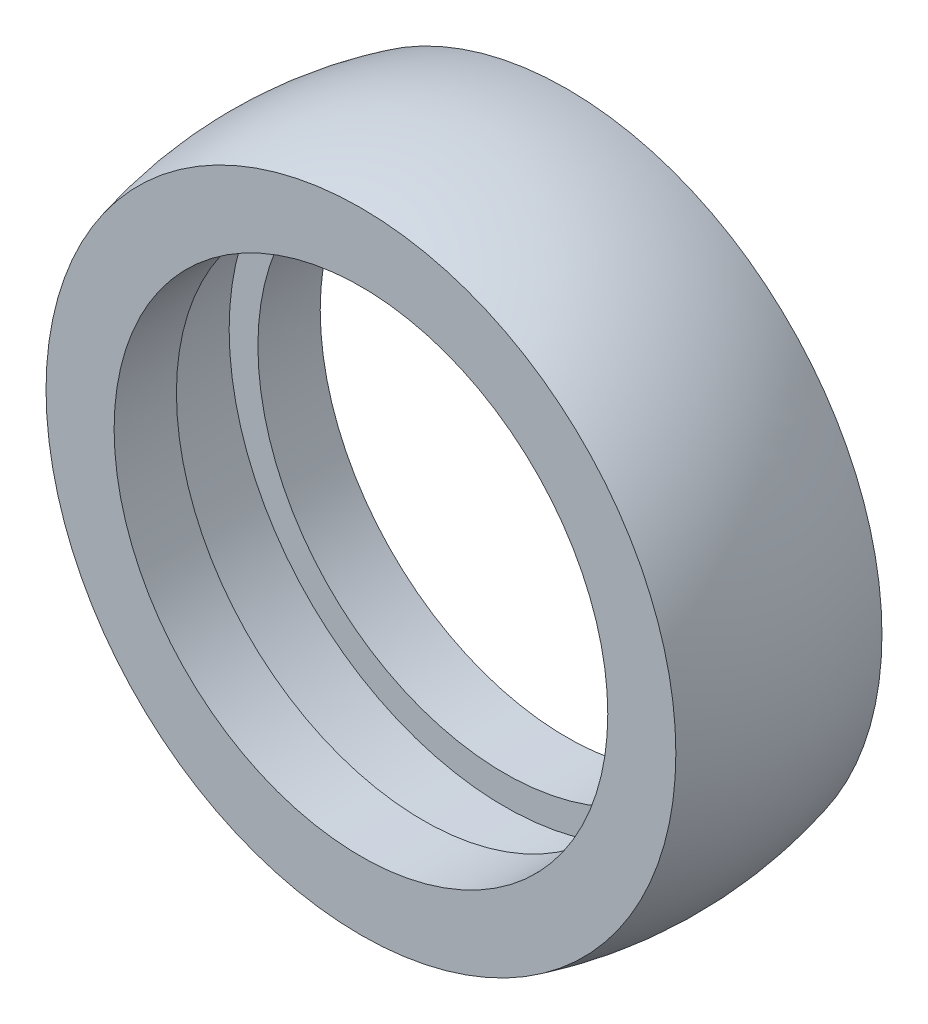
ISO-10303-21;
HEADER;
FILE_DESCRIPTION(('STEP AP214'),'2;1');
FILE_NAME('part.step','',(''),(''),'','','');
FILE_SCHEMA(('AUTOMOTIVE_DESIGN { 1 0 10303 214 1 1 1 1 }'));
ENDSEC;
DATA;
#1=APPLICATION_CONTEXT('core data for automotive mechanical design processes');
#2=APPLICATION_PROTOCOL_DEFINITION('international standard','automotive_design',2000,#1);
#3=PRODUCT_CONTEXT('',#1,'mechanical');
#4=PRODUCT('Part','Part','',(#3));
#5=PRODUCT_RELATED_PRODUCT_CATEGORY('part','',(#4));
#6=PRODUCT_DEFINITION_FORMATION('','',#4);
#7=PRODUCT_DEFINITION_CONTEXT('part definition',#1,'design');
#8=PRODUCT_DEFINITION('design','',#6,#7);
#9=PRODUCT_DEFINITION_SHAPE('','',#8);
#10=(LENGTH_UNIT() NAMED_UNIT(*) SI_UNIT(.MILLI.,.METRE.));
#11=(NAMED_UNIT(*) PLANE_ANGLE_UNIT() SI_UNIT($,.RADIAN.));
#12=(NAMED_UNIT(*) SI_UNIT($,.STERADIAN.) SOLID_ANGLE_UNIT());
#13=UNCERTAINTY_MEASURE_WITH_UNIT(LENGTH_MEASURE(1.E-05),#10,'distance_accuracy_value','');
#14=(GEOMETRIC_REPRESENTATION_CONTEXT(3) GLOBAL_UNCERTAINTY_ASSIGNED_CONTEXT((#13)) GLOBAL_UNIT_ASSIGNED_CONTEXT((#10,
#11,#12)) REPRESENTATION_CONTEXT('',''));
#15=CARTESIAN_POINT('',(0.,0.,0.));
#16=DIRECTION('',(0.,0.,1.));
#17=DIRECTION('',(1.,0.,0.));
#18=AXIS2_PLACEMENT_3D('',#15,#16,#17);
#19=CARTESIAN_POINT('',(0.,25.75,10.75));
#20=DIRECTION('',(0.,0.,-1.));
#21=DIRECTION('',(-1.,0.,0.));
#22=AXIS2_PLACEMENT_3D('',#19,#20,#21);
#23=PLANE('',#22);
#24=CARTESIAN_POINT('',(0.,0.,10.75));
#25=DIRECTION('',(0.,0.,1.));
#26=DIRECTION('',(1.,0.,0.));
#27=AXIS2_PLACEMENT_3D('',#24,#25,#26);
#28=CIRCLE('',#27,25.75);
#29=CARTESIAN_POINT('',(25.75,0.,10.75));
#30=VERTEX_POINT('',#29);
#31=EDGE_CURVE('E72',#30,#30,#28,.T.);
#32=ORIENTED_EDGE('',*,*,#31,.F.);
#33=EDGE_LOOP('',(#32));
#34=FACE_BOUND('',#33,.T.);
#35=CARTESIAN_POINT('',(0.,0.,10.75));
#36=DIRECTION('',(0.,0.,1.));
#37=DIRECTION('',(1.,0.,0.));
#38=AXIS2_PLACEMENT_3D('',#35,#36,#37);
#39=CIRCLE('',#38,32.8509544222793);
#40=CARTESIAN_POINT('',(32.8509544222793,0.,10.75));
#41=VERTEX_POINT('',#40);
#42=EDGE_CURVE('E10',#41,#41,#39,.T.);
#43=ORIENTED_EDGE('',*,*,#42,.T.);
#44=EDGE_LOOP('',(#43));
#45=FACE_BOUND('',#44,.T.);
#46=ADVANCED_FACE('F37',(#34,#45),#23,.F.);
#47=CARTESIAN_POINT('',(0.,0.,0.));
#48=DIRECTION('',(0.,0.,1.));
#49=DIRECTION('',(1.,0.,0.));
#50=AXIS2_PLACEMENT_3D('',#47,#48,#49);
#51=DEGENERATE_TOROIDAL_SURFACE('',#50,7.75,42.,.F.);
#52=ORIENTED_EDGE('',*,*,#42,.F.);
#53=EDGE_LOOP('',(#52));
#54=FACE_BOUND('',#53,.T.);
#55=CARTESIAN_POINT('',(0.,0.,-10.75));
#56=DIRECTION('',(0.,0.,1.));
#57=DIRECTION('',(1.,0.,0.));
#58=AXIS2_PLACEMENT_3D('',#55,#56,#57);
#59=CIRCLE('',#58,32.8509544222793);
#60=CARTESIAN_POINT('',(32.8509544222793,0.,-10.75));
#61=VERTEX_POINT('',#60);
#62=EDGE_CURVE('E44',#61,#61,#59,.T.);
#63=ORIENTED_EDGE('',*,*,#62,.T.);
#64=EDGE_LOOP('',(#63));
#65=FACE_BOUND('',#64,.T.);
#66=ADVANCED_FACE('F80',(#54,#65),#51,.F.);
#67=CARTESIAN_POINT('',(0.,25.75,-10.75));
#68=DIRECTION('',(0.,0.,1.));
#69=DIRECTION('',(1.,0.,0.));
#70=AXIS2_PLACEMENT_3D('',#67,#68,#69);
#71=PLANE('',#70);
#72=ORIENTED_EDGE('',*,*,#62,.F.);
#73=EDGE_LOOP('',(#72));
#74=FACE_BOUND('',#73,.T.);
#75=CARTESIAN_POINT('',(0.,0.,-10.75));
#76=DIRECTION('',(0.,0.,1.));
#77=DIRECTION('',(1.,0.,0.));
#78=AXIS2_PLACEMENT_3D('',#75,#76,#77);
#79=CIRCLE('',#78,25.75);
#80=CARTESIAN_POINT('',(25.75,0.,-10.75));
#81=VERTEX_POINT('',#80);
#82=EDGE_CURVE('E49',#81,#81,#79,.T.);
#83=ORIENTED_EDGE('',*,*,#82,.T.);
#84=EDGE_LOOP('',(#83));
#85=FACE_BOUND('',#84,.T.);
#86=ADVANCED_FACE('F84',(#74,#85),#71,.F.);
#87=CARTESIAN_POINT('',(0.,0.,733.316005498148));
#88=DIRECTION('',(0.,0.,1.));
#89=DIRECTION('',(1.,0.,0.));
#90=AXIS2_PLACEMENT_3D('',#87,#88,#89);
#91=CYLINDRICAL_SURFACE('',#90,25.75);
#92=ORIENTED_EDGE('',*,*,#82,.F.);
#93=EDGE_LOOP('',(#92));
#94=FACE_BOUND('',#93,.T.);
#95=CARTESIAN_POINT('',(0.,0.,-4.24999999999998));
#96=DIRECTION('',(0.,0.,1.));
#97=DIRECTION('',(1.,0.,0.));
#98=AXIS2_PLACEMENT_3D('',#95,#96,#97);
#99=CIRCLE('',#98,25.75);
#100=CARTESIAN_POINT('',(25.75,0.,-4.24999999999998));
#101=VERTEX_POINT('',#100);
#102=EDGE_CURVE('E54',#101,#101,#99,.T.);
#103=ORIENTED_EDGE('',*,*,#102,.T.);
#104=EDGE_LOOP('',(#103));
#105=FACE_BOUND('',#104,.T.);
#106=ADVANCED_FACE('F89',(#94,#105),#91,.F.);
#107=CARTESIAN_POINT('',(0.,28.75,-4.25));
#108=DIRECTION('',(0.,0.,-1.));
#109=DIRECTION('',(-1.,0.,0.));
#110=AXIS2_PLACEMENT_3D('',#107,#108,#109);
#111=PLANE('',#110);
#112=ORIENTED_EDGE('',*,*,#102,.F.);
#113=EDGE_LOOP('',(#112));
#114=FACE_BOUND('',#113,.T.);
#115=CARTESIAN_POINT('',(0.,0.,-4.24999999999998));
#116=DIRECTION('',(0.,0.,1.));
#117=DIRECTION('',(1.,0.,0.));
#118=AXIS2_PLACEMENT_3D('',#115,#116,#117);
#119=CIRCLE('',#118,28.75);
#120=CARTESIAN_POINT('',(28.75,0.,-4.24999999999998));
#121=VERTEX_POINT('',#120);
#122=EDGE_CURVE('E60',#121,#121,#119,.T.);
#123=ORIENTED_EDGE('',*,*,#122,.T.);
#124=EDGE_LOOP('',(#123));
#125=FACE_BOUND('',#124,.T.);
#126=ADVANCED_FACE('F95',(#114,#125),#111,.F.);
#127=CARTESIAN_POINT('',(0.,0.,733.316005498148));
#128=DIRECTION('',(0.,0.,1.));
#129=DIRECTION('',(1.,0.,0.));
#130=AXIS2_PLACEMENT_3D('',#127,#128,#129);
#131=CYLINDRICAL_SURFACE('',#130,28.75);
#132=ORIENTED_EDGE('',*,*,#122,.F.);
#133=EDGE_LOOP('',(#132));
#134=FACE_BOUND('',#133,.T.);
#135=CARTESIAN_POINT('',(0.,0.,4.24999999999998));
#136=DIRECTION('',(0.,0.,1.));
#137=DIRECTION('',(1.,0.,0.));
#138=AXIS2_PLACEMENT_3D('',#135,#136,#137);
#139=CIRCLE('',#138,28.75);
#140=CARTESIAN_POINT('',(28.75,0.,4.24999999999998));
#141=VERTEX_POINT('',#140);
#142=EDGE_CURVE('E64',#141,#141,#139,.T.);
#143=ORIENTED_EDGE('',*,*,#142,.T.);
#144=EDGE_LOOP('',(#143));
#145=FACE_BOUND('',#144,.T.);
#146=ADVANCED_FACE('F99',(#134,#145),#131,.F.);
#147=CARTESIAN_POINT('',(0.,25.75,4.25));
#148=DIRECTION('',(0.,0.,1.));
#149=DIRECTION('',(1.,0.,0.));
#150=AXIS2_PLACEMENT_3D('',#147,#148,#149);
#151=PLANE('',#150);
#152=ORIENTED_EDGE('',*,*,#142,.F.);
#153=EDGE_LOOP('',(#152));
#154=FACE_BOUND('',#153,.T.);
#155=CARTESIAN_POINT('',(0.,0.,4.24999999999998));
#156=DIRECTION('',(0.,0.,1.));
#157=DIRECTION('',(1.,0.,0.));
#158=AXIS2_PLACEMENT_3D('',#155,#156,#157);
#159=CIRCLE('',#158,25.75);
#160=CARTESIAN_POINT('',(25.75,0.,4.24999999999998));
#161=VERTEX_POINT('',#160);
#162=EDGE_CURVE('E68',#161,#161,#159,.T.);
#163=ORIENTED_EDGE('',*,*,#162,.T.);
#164=EDGE_LOOP('',(#163));
#165=FACE_BOUND('',#164,.T.);
#166=ADVANCED_FACE('F103',(#154,#165),#151,.F.);
#167=CARTESIAN_POINT('',(0.,0.,733.316005498148));
#168=DIRECTION('',(0.,0.,1.));
#169=DIRECTION('',(1.,0.,0.));
#170=AXIS2_PLACEMENT_3D('',#167,#168,#169);
#171=CYLINDRICAL_SURFACE('',#170,25.75);
#172=ORIENTED_EDGE('',*,*,#162,.F.);
#173=EDGE_LOOP('',(#172));
#174=FACE_BOUND('',#173,.T.);
#175=ORIENTED_EDGE('',*,*,#31,.T.);
#176=EDGE_LOOP('',(#175));
#177=FACE_BOUND('',#176,.T.);
#178=ADVANCED_FACE('F77',(#174,#177),#171,.F.);
#179=CLOSED_SHELL('',(#46,#66,#86,#106,#126,#146,#166,#178));
#180=MANIFOLD_SOLID_BREP('B2',#179);
#181=ADVANCED_BREP_SHAPE_REPRESENTATION('',(#18,#180),#14);
#182=SHAPE_DEFINITION_REPRESENTATION(#9,#181);
ENDSEC;
END-ISO-10303-21;
